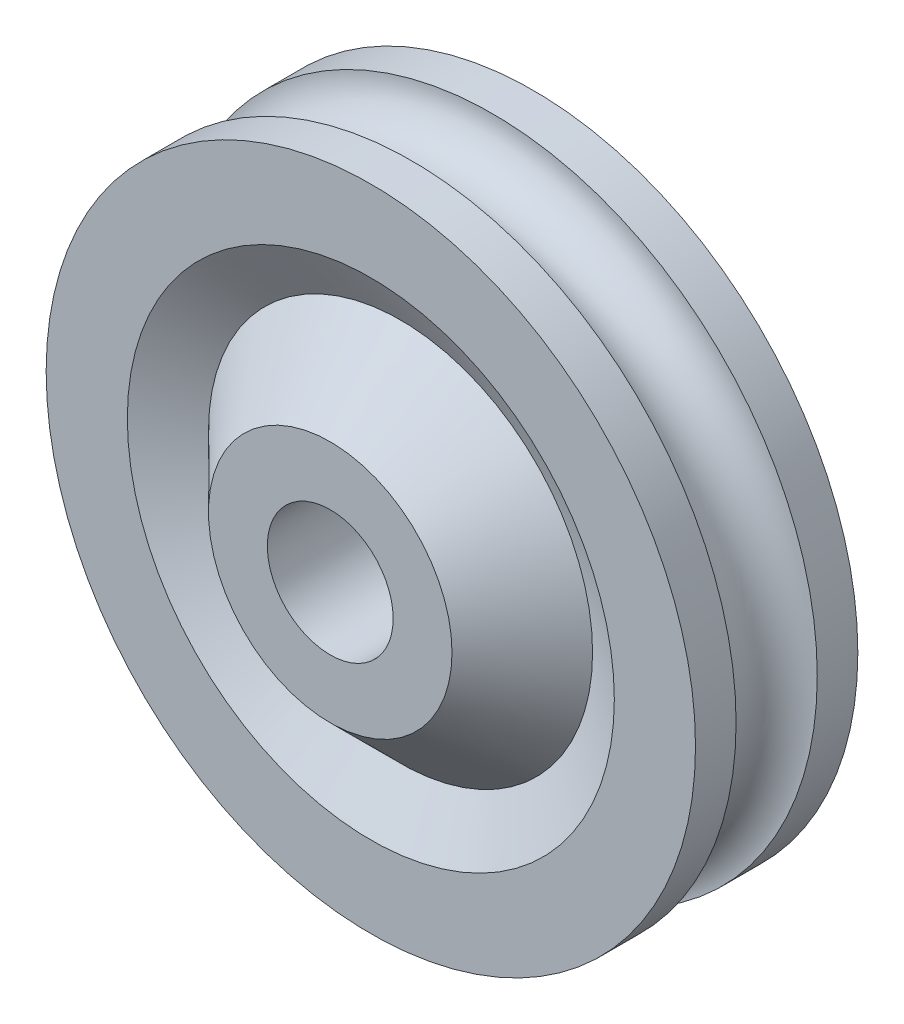
ISO-10303-21;
HEADER;
FILE_DESCRIPTION(('STEP AP214'),'2;1');
FILE_NAME('part.step','',(''),(''),'','','');
FILE_SCHEMA(('AUTOMOTIVE_DESIGN { 1 0 10303 214 1 1 1 1 }'));
ENDSEC;
DATA;
#1=APPLICATION_CONTEXT('core data for automotive mechanical design processes');
#2=APPLICATION_PROTOCOL_DEFINITION('international standard','automotive_design',2000,#1);
#3=PRODUCT_CONTEXT('',#1,'mechanical');
#4=PRODUCT('Part','Part','',(#3));
#5=PRODUCT_RELATED_PRODUCT_CATEGORY('part','',(#4));
#6=PRODUCT_DEFINITION_FORMATION('','',#4);
#7=PRODUCT_DEFINITION_CONTEXT('part definition',#1,'design');
#8=PRODUCT_DEFINITION('design','',#6,#7);
#9=PRODUCT_DEFINITION_SHAPE('','',#8);
#10=(LENGTH_UNIT() NAMED_UNIT(*) SI_UNIT(.MILLI.,.METRE.));
#11=(NAMED_UNIT(*) PLANE_ANGLE_UNIT() SI_UNIT($,.RADIAN.));
#12=(NAMED_UNIT(*) SI_UNIT($,.STERADIAN.) SOLID_ANGLE_UNIT());
#13=UNCERTAINTY_MEASURE_WITH_UNIT(LENGTH_MEASURE(1.E-05),#10,'distance_accuracy_value','');
#14=(GEOMETRIC_REPRESENTATION_CONTEXT(3) GLOBAL_UNCERTAINTY_ASSIGNED_CONTEXT((#13)) GLOBAL_UNIT_ASSIGNED_CONTEXT((#10,
#11,#12)) REPRESENTATION_CONTEXT('',''));
#15=CARTESIAN_POINT('',(0.,0.,0.));
#16=DIRECTION('',(0.,0.,1.));
#17=DIRECTION('',(1.,0.,0.));
#18=AXIS2_PLACEMENT_3D('',#15,#16,#17);
#19=CARTESIAN_POINT('',(0.,0.,3.00000000000001));
#20=DIRECTION('',(0.,0.,1.));
#21=DIRECTION('',(1.,0.,0.));
#22=AXIS2_PLACEMENT_3D('',#19,#20,#21);
#23=PLANE('',#22);
#24=CARTESIAN_POINT('',(0.,0.,3.00000000000001));
#25=DIRECTION('',(0.,0.,1.));
#26=DIRECTION('',(1.,0.,0.));
#27=AXIS2_PLACEMENT_3D('',#24,#25,#26);
#28=CIRCLE('',#27,1.55);
#29=CARTESIAN_POINT('',(1.55,0.,3.00000000000001));
#30=VERTEX_POINT('',#29);
#31=EDGE_CURVE('E65',#30,#30,#28,.T.);
#32=ORIENTED_EDGE('',*,*,#31,.F.);
#33=EDGE_LOOP('',(#32));
#34=FACE_BOUND('',#33,.T.);
#35=CARTESIAN_POINT('',(0.,0.,3.));
#36=DIRECTION('',(0.,0.,1.));
#37=DIRECTION('',(1.,0.,0.));
#38=AXIS2_PLACEMENT_3D('',#35,#36,#37);
#39=CIRCLE('',#38,3.);
#40=CARTESIAN_POINT('',(3.,0.,3.));
#41=VERTEX_POINT('',#40);
#42=EDGE_CURVE('E42',#41,#41,#39,.T.);
#43=ORIENTED_EDGE('',*,*,#42,.T.);
#44=EDGE_LOOP('',(#43));
#45=FACE_BOUND('',#44,.T.);
#46=ADVANCED_FACE('F35',(#34,#45),#23,.T.);
#47=CARTESIAN_POINT('',(0.,0.,1.));
#48=DIRECTION('',(0.,0.,1.));
#49=DIRECTION('',(1.,0.,0.));
#50=AXIS2_PLACEMENT_3D('',#47,#48,#49);
#51=CONICAL_SURFACE('',#50,4.2679491924311,1.0471975511966);
#52=CARTESIAN_POINT('',(0.,0.,1.26794919243113));
#53=DIRECTION('',(0.,0.,-1.));
#54=DIRECTION('',(-1.,0.,0.));
#55=AXIS2_PLACEMENT_3D('',#52,#53,#54);
#56=CIRCLE('',#55,4.73205080756888);
#57=CARTESIAN_POINT('',(-4.73205080756888,0.,1.26794919243113));
#58=VERTEX_POINT('',#57);
#59=EDGE_CURVE('E10',#58,#58,#56,.T.);
#60=ORIENTED_EDGE('',*,*,#59,.T.);
#61=EDGE_LOOP('',(#60));
#62=FACE_BOUND('',#61,.T.);
#63=CARTESIAN_POINT('',(0.,0.,2.));
#64=DIRECTION('',(0.,0.,1.));
#65=DIRECTION('',(1.,0.,0.));
#66=AXIS2_PLACEMENT_3D('',#63,#64,#65);
#67=CIRCLE('',#66,6.);
#68=CARTESIAN_POINT('',(6.,0.,2.));
#69=VERTEX_POINT('',#68);
#70=EDGE_CURVE('E46',#69,#69,#67,.T.);
#71=ORIENTED_EDGE('',*,*,#70,.T.);
#72=EDGE_LOOP('',(#71));
#73=FACE_BOUND('',#72,.T.);
#74=ADVANCED_FACE('F81',(#62,#73),#51,.F.);
#75=CARTESIAN_POINT('',(0.,0.,2.));
#76=DIRECTION('',(0.,0.,-1.));
#77=DIRECTION('',(-1.,0.,0.));
#78=AXIS2_PLACEMENT_3D('',#75,#76,#77);
#79=PLANE('',#78);
#80=ORIENTED_EDGE('',*,*,#70,.F.);
#81=EDGE_LOOP('',(#80));
#82=FACE_BOUND('',#81,.T.);
#83=CARTESIAN_POINT('',(0.,0.,2.));
#84=DIRECTION('',(0.,0.,1.));
#85=DIRECTION('',(1.,0.,0.));
#86=AXIS2_PLACEMENT_3D('',#83,#84,#85);
#87=CIRCLE('',#86,8.);
#88=CARTESIAN_POINT('',(8.,0.,2.));
#89=VERTEX_POINT('',#88);
#90=EDGE_CURVE('E50',#89,#89,#87,.T.);
#91=ORIENTED_EDGE('',*,*,#90,.T.);
#92=EDGE_LOOP('',(#91));
#93=FACE_BOUND('',#92,.T.);
#94=ADVANCED_FACE('F85',(#82,#93),#79,.F.);
#95=CARTESIAN_POINT('',(0.,0.,2.));
#96=DIRECTION('',(0.,0.,1.));
#97=DIRECTION('',(1.,0.,0.));
#98=AXIS2_PLACEMENT_3D('',#95,#96,#97);
#99=CYLINDRICAL_SURFACE('',#98,8.);
#100=CARTESIAN_POINT('',(0.,0.,0.999999999999998));
#101=DIRECTION('',(0.,0.,1.));
#102=DIRECTION('',(1.,0.,0.));
#103=AXIS2_PLACEMENT_3D('',#100,#101,#102);
#104=CIRCLE('',#103,8.);
#105=CARTESIAN_POINT('',(8.,0.,0.999999999999998));
#106=VERTEX_POINT('',#105);
#107=EDGE_CURVE('E55',#106,#106,#104,.T.);
#108=ORIENTED_EDGE('',*,*,#107,.T.);
#109=EDGE_LOOP('',(#108));
#110=FACE_BOUND('',#109,.T.);
#111=ORIENTED_EDGE('',*,*,#90,.F.);
#112=EDGE_LOOP('',(#111));
#113=FACE_BOUND('',#112,.T.);
#114=ADVANCED_FACE('F90',(#110,#113),#99,.T.);
#115=CARTESIAN_POINT('',(0.,0.,0.));
#116=DIRECTION('',(0.,0.,1.));
#117=DIRECTION('',(1.,0.,0.));
#118=AXIS2_PLACEMENT_3D('',#115,#116,#117);
#119=TOROIDAL_SURFACE('',#118,8.,0.999999999999998);
#120=ORIENTED_EDGE('',*,*,#107,.F.);
#121=EDGE_LOOP('',(#120));
#122=FACE_BOUND('',#121,.T.);
#123=CARTESIAN_POINT('',(0.,0.,-0.999999999999998));
#124=DIRECTION('',(0.,0.,1.));
#125=DIRECTION('',(1.,0.,0.));
#126=AXIS2_PLACEMENT_3D('',#123,#124,#125);
#127=CIRCLE('',#126,8.);
#128=CARTESIAN_POINT('',(8.,0.,-0.999999999999998));
#129=VERTEX_POINT('',#128);
#130=EDGE_CURVE('E58',#129,#129,#127,.T.);
#131=ORIENTED_EDGE('',*,*,#130,.T.);
#132=EDGE_LOOP('',(#131));
#133=FACE_BOUND('',#132,.T.);
#134=ADVANCED_FACE('F92',(#122,#133),#119,.F.);
#135=CARTESIAN_POINT('',(0.,0.,-2.));
#136=DIRECTION('',(0.,0.,1.));
#137=DIRECTION('',(1.,0.,0.));
#138=AXIS2_PLACEMENT_3D('',#135,#136,#137);
#139=CIRCLE('',#138,8.);
#140=CARTESIAN_POINT('',(8.,0.,-2.));
#141=VERTEX_POINT('',#140);
#142=EDGE_CURVE('E61',#141,#141,#139,.T.);
#143=ORIENTED_EDGE('',*,*,#142,.T.);
#144=EDGE_LOOP('',(#143));
#145=FACE_BOUND('',#144,.T.);
#146=ORIENTED_EDGE('',*,*,#130,.F.);
#147=EDGE_LOOP('',(#146));
#148=FACE_BOUND('',#147,.T.);
#149=ADVANCED_FACE('F95',(#145,#148),#99,.T.);
#150=CARTESIAN_POINT('',(0.,0.,-2.));
#151=DIRECTION('',(0.,0.,-1.));
#152=DIRECTION('',(-1.,0.,0.));
#153=AXIS2_PLACEMENT_3D('',#150,#151,#152);
#154=PLANE('',#153);
#155=CARTESIAN_POINT('',(0.,0.,-2.));
#156=DIRECTION('',(0.,0.,1.));
#157=DIRECTION('',(1.,0.,0.));
#158=AXIS2_PLACEMENT_3D('',#155,#156,#157);
#159=CIRCLE('',#158,1.55);
#160=CARTESIAN_POINT('',(1.55,0.,-2.));
#161=VERTEX_POINT('',#160);
#162=EDGE_CURVE('E64',#161,#161,#159,.T.);
#163=ORIENTED_EDGE('',*,*,#162,.T.);
#164=EDGE_LOOP('',(#163));
#165=FACE_BOUND('',#164,.T.);
#166=ORIENTED_EDGE('',*,*,#142,.F.);
#167=EDGE_LOOP('',(#166));
#168=FACE_BOUND('',#167,.T.);
#169=ADVANCED_FACE('F71',(#165,#168),#154,.T.);
#170=CARTESIAN_POINT('',(0.,0.,-2.));
#171=DIRECTION('',(0.,0.,1.));
#172=DIRECTION('',(1.,0.,0.));
#173=AXIS2_PLACEMENT_3D('',#170,#171,#172);
#174=CYLINDRICAL_SURFACE('',#173,1.55);
#175=ORIENTED_EDGE('',*,*,#162,.F.);
#176=EDGE_LOOP('',(#175));
#177=FACE_BOUND('',#176,.T.);
#178=ORIENTED_EDGE('',*,*,#31,.T.);
#179=EDGE_LOOP('',(#178));
#180=FACE_BOUND('',#179,.T.);
#181=ADVANCED_FACE('F74',(#177,#180),#174,.F.);
#182=CARTESIAN_POINT('',(0.,0.,3.00000000000003));
#183=DIRECTION('',(0.,0.,-1.));
#184=DIRECTION('',(-1.,0.,0.));
#185=AXIS2_PLACEMENT_3D('',#182,#183,#184);
#186=CONICAL_SURFACE('',#185,3.,0.785398163397443);
#187=ORIENTED_EDGE('',*,*,#59,.F.);
#188=EDGE_LOOP('',(#187));
#189=FACE_BOUND('',#188,.T.);
#190=ORIENTED_EDGE('',*,*,#42,.F.);
#191=EDGE_LOOP('',(#190));
#192=FACE_BOUND('',#191,.T.);
#193=ADVANCED_FACE('F37',(#189,#192),#186,.T.);
#194=CLOSED_SHELL('',(#46,#74,#94,#114,#134,#149,#169,#181,#193));
#195=MANIFOLD_SOLID_BREP('B2',#194);
#196=ADVANCED_BREP_SHAPE_REPRESENTATION('',(#18,#195),#14);
#197=SHAPE_DEFINITION_REPRESENTATION(#9,#196);
ENDSEC;
END-ISO-10303-21;
